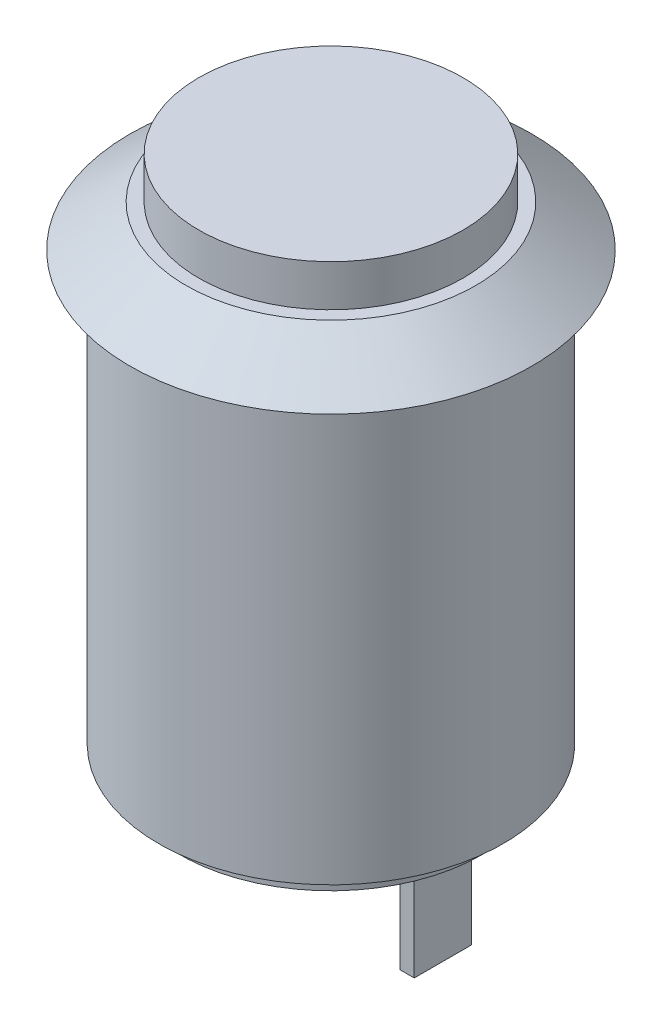
ISO-10303-21;
HEADER;
FILE_DESCRIPTION(('STEP AP214'),'2;1');
FILE_NAME('part.step','',(''),(''),'','','');
FILE_SCHEMA(('AUTOMOTIVE_DESIGN { 1 0 10303 214 1 1 1 1 }'));
ENDSEC;
DATA;
#1=APPLICATION_CONTEXT('core data for automotive mechanical design processes');
#2=APPLICATION_PROTOCOL_DEFINITION('international standard','automotive_design',2000,#1);
#3=PRODUCT_CONTEXT('',#1,'mechanical');
#4=PRODUCT('Part','Part','',(#3));
#5=PRODUCT_RELATED_PRODUCT_CATEGORY('part','',(#4));
#6=PRODUCT_DEFINITION_FORMATION('','',#4);
#7=PRODUCT_DEFINITION_CONTEXT('part definition',#1,'design');
#8=PRODUCT_DEFINITION('design','',#6,#7);
#9=PRODUCT_DEFINITION_SHAPE('','',#8);
#10=(LENGTH_UNIT() NAMED_UNIT(*) SI_UNIT(.MILLI.,.METRE.));
#11=(NAMED_UNIT(*) PLANE_ANGLE_UNIT() SI_UNIT($,.RADIAN.));
#12=(NAMED_UNIT(*) SI_UNIT($,.STERADIAN.) SOLID_ANGLE_UNIT());
#13=UNCERTAINTY_MEASURE_WITH_UNIT(LENGTH_MEASURE(1.E-05),#10,'distance_accuracy_value','');
#14=(GEOMETRIC_REPRESENTATION_CONTEXT(3) GLOBAL_UNCERTAINTY_ASSIGNED_CONTEXT((#13)) GLOBAL_UNIT_ASSIGNED_CONTEXT((#10,
#11,#12)) REPRESENTATION_CONTEXT('',''));
#15=CARTESIAN_POINT('',(0.,0.,0.));
#16=DIRECTION('',(0.,0.,1.));
#17=DIRECTION('',(1.,0.,0.));
#18=AXIS2_PLACEMENT_3D('',#15,#16,#17);
#19=CARTESIAN_POINT('',(0.,-15.6,0.));
#20=DIRECTION('',(0.,-1.,0.));
#21=DIRECTION('',(1.,0.,0.));
#22=AXIS2_PLACEMENT_3D('',#19,#20,#21);
#23=PLANE('',#22);
#24=CARTESIAN_POINT('',(0.,-15.6,0.));
#25=DIRECTION('',(0.,-1.,0.));
#26=DIRECTION('',(1.,0.,0.));
#27=AXIS2_PLACEMENT_3D('',#24,#25,#26);
#28=CIRCLE('',#27,5.26406953456615);
#29=CARTESIAN_POINT('',(5.26406953456615,-15.6,0.));
#30=VERTEX_POINT('',#29);
#31=EDGE_CURVE('E197',#30,#30,#28,.T.);
#32=ORIENTED_EDGE('',*,*,#31,.T.);
#33=EDGE_LOOP('',(#32));
#34=FACE_BOUND('',#33,.T.);
#35=DIRECTION('',(-1.,0.,0.));
#36=VECTOR('',#35,1.);
#37=CARTESIAN_POINT('',(-3.9,-15.6,1.));
#38=LINE('',#37,#36);
#39=CARTESIAN_POINT('',(-3.4,-15.6,1.));
#40=VERTEX_POINT('',#39);
#41=CARTESIAN_POINT('',(-3.9,-15.6,1.));
#42=VERTEX_POINT('',#41);
#43=EDGE_CURVE('E148',#40,#42,#38,.T.);
#44=ORIENTED_EDGE('',*,*,#43,.F.);
#45=DIRECTION('',(0.,0.,1.));
#46=VECTOR('',#45,1.);
#47=CARTESIAN_POINT('',(-3.4,-15.6,1.));
#48=LINE('',#47,#46);
#49=CARTESIAN_POINT('',(-3.4,-15.6,-1.));
#50=VERTEX_POINT('',#49);
#51=EDGE_CURVE('E143',#50,#40,#48,.T.);
#52=ORIENTED_EDGE('',*,*,#51,.F.);
#53=DIRECTION('',(1.,0.,0.));
#54=VECTOR('',#53,1.);
#55=CARTESIAN_POINT('',(-3.9,-15.6,-1.));
#56=LINE('',#55,#54);
#57=CARTESIAN_POINT('',(-3.9,-15.6,-1.));
#58=VERTEX_POINT('',#57);
#59=EDGE_CURVE('E168',#58,#50,#56,.T.);
#60=ORIENTED_EDGE('',*,*,#59,.F.);
#61=DIRECTION('',(0.,0.,-1.));
#62=VECTOR('',#61,1.);
#63=CARTESIAN_POINT('',(-3.9,-15.6,1.));
#64=LINE('',#63,#62);
#65=EDGE_CURVE('E180',#42,#58,#64,.T.);
#66=ORIENTED_EDGE('',*,*,#65,.F.);
#67=EDGE_LOOP('',(#44,#52,#60,#66));
#68=FACE_BOUND('',#67,.T.);
#69=DIRECTION('',(-1.,0.,0.));
#70=VECTOR('',#69,1.);
#71=CARTESIAN_POINT('',(3.4,-15.6,1.));
#72=LINE('',#71,#70);
#73=CARTESIAN_POINT('',(3.9,-15.6,1.));
#74=VERTEX_POINT('',#73);
#75=CARTESIAN_POINT('',(3.4,-15.6,1.));
#76=VERTEX_POINT('',#75);
#77=EDGE_CURVE('E141',#74,#76,#72,.T.);
#78=ORIENTED_EDGE('',*,*,#77,.F.);
#79=DIRECTION('',(0.,0.,1.));
#80=VECTOR('',#79,1.);
#81=CARTESIAN_POINT('',(3.9,-15.6,1.));
#82=LINE('',#81,#80);
#83=CARTESIAN_POINT('',(3.9,-15.6,-0.999999999999999));
#84=VERTEX_POINT('',#83);
#85=EDGE_CURVE('E135',#84,#74,#82,.T.);
#86=ORIENTED_EDGE('',*,*,#85,.F.);
#87=DIRECTION('',(1.,0.,0.));
#88=VECTOR('',#87,1.);
#89=CARTESIAN_POINT('',(3.4,-15.6,-0.999999999999999));
#90=LINE('',#89,#88);
#91=CARTESIAN_POINT('',(3.4,-15.6,-0.999999999999999));
#92=VERTEX_POINT('',#91);
#93=EDGE_CURVE('E119',#92,#84,#90,.T.);
#94=ORIENTED_EDGE('',*,*,#93,.F.);
#95=DIRECTION('',(0.,0.,-1.));
#96=VECTOR('',#95,1.);
#97=CARTESIAN_POINT('',(3.4,-15.6,1.));
#98=LINE('',#97,#96);
#99=EDGE_CURVE('E128',#76,#92,#98,.T.);
#100=ORIENTED_EDGE('',*,*,#99,.F.);
#101=EDGE_LOOP('',(#78,#86,#94,#100));
#102=FACE_BOUND('',#101,.T.);
#103=ADVANCED_FACE('F51',(#34,#68,#102),#23,.T.);
#104=CARTESIAN_POINT('',(0.,-14.9,0.));
#105=DIRECTION('',(0.,1.,0.));
#106=DIRECTION('',(-1.,0.,0.));
#107=AXIS2_PLACEMENT_3D('',#104,#105,#106);
#108=PLANE('',#107);
#109=CARTESIAN_POINT('',(0.,-14.9,0.));
#110=DIRECTION('',(0.,-1.,0.));
#111=DIRECTION('',(1.,0.,0.));
#112=AXIS2_PLACEMENT_3D('',#109,#110,#111);
#113=CIRCLE('',#112,5.26406953456615);
#114=CARTESIAN_POINT('',(5.26406953456615,-14.9,0.));
#115=VERTEX_POINT('',#114);
#116=EDGE_CURVE('E11',#115,#115,#113,.T.);
#117=ORIENTED_EDGE('',*,*,#116,.F.);
#118=EDGE_LOOP('',(#117));
#119=FACE_BOUND('',#118,.T.);
#120=CARTESIAN_POINT('',(0.,-14.9,0.));
#121=DIRECTION('',(0.,1.,0.));
#122=DIRECTION('',(-1.,0.,0.));
#123=AXIS2_PLACEMENT_3D('',#120,#121,#122);
#124=CIRCLE('',#123,6.);
#125=CARTESIAN_POINT('',(-6.,-14.9,0.));
#126=VERTEX_POINT('',#125);
#127=EDGE_CURVE('E55',#126,#126,#124,.T.);
#128=ORIENTED_EDGE('',*,*,#127,.F.);
#129=EDGE_LOOP('',(#128));
#130=FACE_BOUND('',#129,.T.);
#131=ADVANCED_FACE('F53',(#119,#130),#108,.F.);
#132=CARTESIAN_POINT('',(0.,2.9,0.));
#133=DIRECTION('',(0.,1.,0.));
#134=DIRECTION('',(-1.,0.,0.));
#135=AXIS2_PLACEMENT_3D('',#132,#133,#134);
#136=CYLINDRICAL_SURFACE('',#135,6.);
#137=CARTESIAN_POINT('',(0.,0.,0.));
#138=DIRECTION('',(0.,1.,0.));
#139=DIRECTION('',(-1.,0.,0.));
#140=AXIS2_PLACEMENT_3D('',#137,#138,#139);
#141=CIRCLE('',#140,6.);
#142=CARTESIAN_POINT('',(-6.,0.,0.));
#143=VERTEX_POINT('',#142);
#144=EDGE_CURVE('E216',#143,#143,#141,.T.);
#145=ORIENTED_EDGE('',*,*,#144,.F.);
#146=EDGE_LOOP('',(#145));
#147=FACE_BOUND('',#146,.T.);
#148=ORIENTED_EDGE('',*,*,#127,.T.);
#149=EDGE_LOOP('',(#148));
#150=FACE_BOUND('',#149,.T.);
#151=ADVANCED_FACE('F225',(#147,#150),#136,.T.);
#152=CARTESIAN_POINT('',(6.,0.,0.));
#153=DIRECTION('',(0.,1.,0.));
#154=DIRECTION('',(-1.,0.,0.));
#155=AXIS2_PLACEMENT_3D('',#152,#153,#154);
#156=PLANE('',#155);
#157=CARTESIAN_POINT('',(0.,0.,0.));
#158=DIRECTION('',(0.,1.,0.));
#159=DIRECTION('',(-1.,0.,0.));
#160=AXIS2_PLACEMENT_3D('',#157,#158,#159);
#161=CIRCLE('',#160,7.);
#162=CARTESIAN_POINT('',(-7.,0.,0.));
#163=VERTEX_POINT('',#162);
#164=EDGE_CURVE('E213',#163,#163,#161,.T.);
#165=ORIENTED_EDGE('',*,*,#164,.F.);
#166=EDGE_LOOP('',(#165));
#167=FACE_BOUND('',#166,.T.);
#168=ORIENTED_EDGE('',*,*,#144,.T.);
#169=EDGE_LOOP('',(#168));
#170=FACE_BOUND('',#169,.T.);
#171=ADVANCED_FACE('F234',(#167,#170),#156,.F.);
#172=CARTESIAN_POINT('',(0.,0.,0.));
#173=DIRECTION('',(0.,-1.,0.));
#174=DIRECTION('',(1.,0.,0.));
#175=AXIS2_PLACEMENT_3D('',#172,#173,#174);
#176=CONICAL_SURFACE('',#175,7.,0.933056955493122);
#177=CARTESIAN_POINT('',(0.,1.45,0.));
#178=DIRECTION('',(0.,1.,0.));
#179=DIRECTION('',(-1.,0.,0.));
#180=AXIS2_PLACEMENT_3D('',#177,#178,#179);
#181=CIRCLE('',#180,5.04327974389335);
#182=CARTESIAN_POINT('',(-5.04327974389335,1.45,0.));
#183=VERTEX_POINT('',#182);
#184=EDGE_CURVE('E209',#183,#183,#181,.T.);
#185=ORIENTED_EDGE('',*,*,#184,.F.);
#186=EDGE_LOOP('',(#185));
#187=FACE_BOUND('',#186,.T.);
#188=ORIENTED_EDGE('',*,*,#164,.T.);
#189=EDGE_LOOP('',(#188));
#190=FACE_BOUND('',#189,.T.);
#191=ADVANCED_FACE('F264',(#187,#190),#176,.T.);
#192=CARTESIAN_POINT('',(5.04327974389335,1.45,0.));
#193=DIRECTION('',(0.,-1.,0.));
#194=DIRECTION('',(1.,0.,0.));
#195=AXIS2_PLACEMENT_3D('',#192,#193,#194);
#196=PLANE('',#195);
#197=CARTESIAN_POINT('',(0.,1.45,0.));
#198=DIRECTION('',(0.,1.,0.));
#199=DIRECTION('',(-1.,0.,0.));
#200=AXIS2_PLACEMENT_3D('',#197,#198,#199);
#201=CIRCLE('',#200,4.6);
#202=CARTESIAN_POINT('',(-4.6,1.45,0.));
#203=VERTEX_POINT('',#202);
#204=EDGE_CURVE('E205',#203,#203,#201,.T.);
#205=ORIENTED_EDGE('',*,*,#204,.F.);
#206=EDGE_LOOP('',(#205));
#207=FACE_BOUND('',#206,.T.);
#208=ORIENTED_EDGE('',*,*,#184,.T.);
#209=EDGE_LOOP('',(#208));
#210=FACE_BOUND('',#209,.T.);
#211=ADVANCED_FACE('F260',(#207,#210),#196,.F.);
#212=CARTESIAN_POINT('',(0.,2.9,0.));
#213=DIRECTION('',(0.,1.,0.));
#214=DIRECTION('',(-1.,0.,0.));
#215=AXIS2_PLACEMENT_3D('',#212,#213,#214);
#216=CYLINDRICAL_SURFACE('',#215,4.6);
#217=CARTESIAN_POINT('',(0.,2.9,0.));
#218=DIRECTION('',(0.,1.,0.));
#219=DIRECTION('',(-1.,0.,0.));
#220=AXIS2_PLACEMENT_3D('',#217,#218,#219);
#221=CIRCLE('',#220,4.6);
#222=CARTESIAN_POINT('',(-4.6,2.9,0.));
#223=VERTEX_POINT('',#222);
#224=EDGE_CURVE('E200',#223,#223,#221,.T.);
#225=ORIENTED_EDGE('',*,*,#224,.F.);
#226=EDGE_LOOP('',(#225));
#227=FACE_BOUND('',#226,.T.);
#228=ORIENTED_EDGE('',*,*,#204,.T.);
#229=EDGE_LOOP('',(#228));
#230=FACE_BOUND('',#229,.T.);
#231=ADVANCED_FACE('F253',(#227,#230),#216,.T.);
#232=CARTESIAN_POINT('',(4.6,2.9,0.));
#233=DIRECTION('',(0.,-1.,0.));
#234=DIRECTION('',(1.,0.,0.));
#235=AXIS2_PLACEMENT_3D('',#232,#233,#234);
#236=PLANE('',#235);
#237=ORIENTED_EDGE('',*,*,#224,.T.);
#238=EDGE_LOOP('',(#237));
#239=FACE_BOUND('',#238,.T.);
#240=ADVANCED_FACE('F244',(#239),#236,.F.);
#241=CARTESIAN_POINT('',(0.,-15.6,0.));
#242=DIRECTION('',(0.,1.,0.));
#243=DIRECTION('',(-1.,0.,0.));
#244=AXIS2_PLACEMENT_3D('',#241,#242,#243);
#245=CYLINDRICAL_SURFACE('',#244,5.26406953456615);
#246=ORIENTED_EDGE('',*,*,#31,.F.);
#247=EDGE_LOOP('',(#246));
#248=FACE_BOUND('',#247,.T.);
#249=ORIENTED_EDGE('',*,*,#116,.T.);
#250=EDGE_LOOP('',(#249));
#251=FACE_BOUND('',#250,.T.);
#252=ADVANCED_FACE('F241',(#248,#251),#245,.T.);
#253=CARTESIAN_POINT('',(-3.4,-19.5,1.));
#254=DIRECTION('',(-1.,0.,0.));
#255=DIRECTION('',(0.,0.,1.));
#256=AXIS2_PLACEMENT_3D('',#253,#254,#255);
#257=PLANE('',#256);
#258=ORIENTED_EDGE('',*,*,#51,.T.);
#259=DIRECTION('',(0.,1.,0.));
#260=VECTOR('',#259,1.);
#261=CARTESIAN_POINT('',(-3.4,-19.5,1.));
#262=LINE('',#261,#260);
#263=CARTESIAN_POINT('',(-3.4,-19.5,1.));
#264=VERTEX_POINT('',#263);
#265=EDGE_CURVE('E194',#264,#40,#262,.T.);
#266=ORIENTED_EDGE('',*,*,#265,.F.);
#267=DIRECTION('',(0.,0.,1.));
#268=VECTOR('',#267,1.);
#269=CARTESIAN_POINT('',(-3.4,-19.5,1.));
#270=LINE('',#269,#268);
#271=CARTESIAN_POINT('',(-3.4,-19.5,-1.));
#272=VERTEX_POINT('',#271);
#273=EDGE_CURVE('E163',#272,#264,#270,.T.);
#274=ORIENTED_EDGE('',*,*,#273,.F.);
#275=DIRECTION('',(0.,1.,0.));
#276=VECTOR('',#275,1.);
#277=CARTESIAN_POINT('',(-3.4,-19.5,-1.));
#278=LINE('',#277,#276);
#279=EDGE_CURVE('E176',#272,#50,#278,.T.);
#280=ORIENTED_EDGE('',*,*,#279,.T.);
#281=EDGE_LOOP('',(#258,#266,#274,#280));
#282=FACE_BOUND('',#281,.T.);
#283=ADVANCED_FACE('F243',(#282),#257,.F.);
#284=CARTESIAN_POINT('',(-3.9,-19.5,1.));
#285=DIRECTION('',(0.,0.,-1.));
#286=DIRECTION('',(-1.,0.,0.));
#287=AXIS2_PLACEMENT_3D('',#284,#285,#286);
#288=PLANE('',#287);
#289=ORIENTED_EDGE('',*,*,#43,.T.);
#290=DIRECTION('',(0.,1.,0.));
#291=VECTOR('',#290,1.);
#292=CARTESIAN_POINT('',(-3.9,-19.5,1.));
#293=LINE('',#292,#291);
#294=CARTESIAN_POINT('',(-3.9,-19.5,1.));
#295=VERTEX_POINT('',#294);
#296=EDGE_CURVE('E190',#295,#42,#293,.T.);
#297=ORIENTED_EDGE('',*,*,#296,.F.);
#298=DIRECTION('',(-1.,0.,0.));
#299=VECTOR('',#298,1.);
#300=CARTESIAN_POINT('',(-3.9,-19.5,1.));
#301=LINE('',#300,#299);
#302=EDGE_CURVE('E167',#264,#295,#301,.T.);
#303=ORIENTED_EDGE('',*,*,#302,.F.);
#304=ORIENTED_EDGE('',*,*,#265,.T.);
#305=EDGE_LOOP('',(#289,#297,#303,#304));
#306=FACE_BOUND('',#305,.T.);
#307=ADVANCED_FACE('F250',(#306),#288,.F.);
#308=CARTESIAN_POINT('',(-3.9,-19.5,1.));
#309=DIRECTION('',(1.,0.,0.));
#310=DIRECTION('',(0.,0.,-1.));
#311=AXIS2_PLACEMENT_3D('',#308,#309,#310);
#312=PLANE('',#311);
#313=ORIENTED_EDGE('',*,*,#65,.T.);
#314=DIRECTION('',(0.,1.,0.));
#315=VECTOR('',#314,1.);
#316=CARTESIAN_POINT('',(-3.9,-19.5,-1.));
#317=LINE('',#316,#315);
#318=CARTESIAN_POINT('',(-3.9,-19.5,-1.));
#319=VERTEX_POINT('',#318);
#320=EDGE_CURVE('E76',#319,#58,#317,.T.);
#321=ORIENTED_EDGE('',*,*,#320,.F.);
#322=DIRECTION('',(0.,0.,-1.));
#323=VECTOR('',#322,1.);
#324=CARTESIAN_POINT('',(-3.9,-19.5,1.));
#325=LINE('',#324,#323);
#326=EDGE_CURVE('E171',#295,#319,#325,.T.);
#327=ORIENTED_EDGE('',*,*,#326,.F.);
#328=ORIENTED_EDGE('',*,*,#296,.T.);
#329=EDGE_LOOP('',(#313,#321,#327,#328));
#330=FACE_BOUND('',#329,.T.);
#331=ADVANCED_FACE('F331',(#330),#312,.F.);
#332=CARTESIAN_POINT('',(-3.9,-19.5,-1.));
#333=DIRECTION('',(0.,0.,1.));
#334=DIRECTION('',(1.,0.,0.));
#335=AXIS2_PLACEMENT_3D('',#332,#333,#334);
#336=PLANE('',#335);
#337=ORIENTED_EDGE('',*,*,#59,.T.);
#338=ORIENTED_EDGE('',*,*,#279,.F.);
#339=DIRECTION('',(1.,0.,0.));
#340=VECTOR('',#339,1.);
#341=CARTESIAN_POINT('',(-3.9,-19.5,-1.));
#342=LINE('',#341,#340);
#343=EDGE_CURVE('E174',#319,#272,#342,.T.);
#344=ORIENTED_EDGE('',*,*,#343,.F.);
#345=ORIENTED_EDGE('',*,*,#320,.T.);
#346=EDGE_LOOP('',(#337,#338,#344,#345));
#347=FACE_BOUND('',#346,.T.);
#348=ADVANCED_FACE('F343',(#347),#336,.F.);
#349=CARTESIAN_POINT('',(0.,-19.5,0.));
#350=DIRECTION('',(0.,-1.,0.));
#351=DIRECTION('',(0.,0.,-1.));
#352=AXIS2_PLACEMENT_3D('',#349,#350,#351);
#353=PLANE('',#352);
#354=ORIENTED_EDGE('',*,*,#273,.T.);
#355=ORIENTED_EDGE('',*,*,#302,.T.);
#356=ORIENTED_EDGE('',*,*,#326,.T.);
#357=ORIENTED_EDGE('',*,*,#343,.T.);
#358=EDGE_LOOP('',(#354,#355,#356,#357));
#359=FACE_BOUND('',#358,.T.);
#360=ADVANCED_FACE('F355',(#359),#353,.T.);
#361=CARTESIAN_POINT('',(3.9,-19.5,1.));
#362=DIRECTION('',(-1.,0.,0.));
#363=DIRECTION('',(0.,-1.,0.));
#364=AXIS2_PLACEMENT_3D('',#361,#362,#363);
#365=PLANE('',#364);
#366=ORIENTED_EDGE('',*,*,#85,.T.);
#367=DIRECTION('',(0.,1.,0.));
#368=VECTOR('',#367,1.);
#369=CARTESIAN_POINT('',(3.9,-19.5,1.));
#370=LINE('',#369,#368);
#371=CARTESIAN_POINT('',(3.9,-19.5,1.));
#372=VERTEX_POINT('',#371);
#373=EDGE_CURVE('E473',#372,#74,#370,.T.);
#374=ORIENTED_EDGE('',*,*,#373,.F.);
#375=DIRECTION('',(0.,0.,1.));
#376=VECTOR('',#375,1.);
#377=CARTESIAN_POINT('',(3.9,-19.5,1.));
#378=LINE('',#377,#376);
#379=CARTESIAN_POINT('',(3.9,-19.5,-0.999999999999999));
#380=VERTEX_POINT('',#379);
#381=EDGE_CURVE('E129',#380,#372,#378,.T.);
#382=ORIENTED_EDGE('',*,*,#381,.F.);
#383=DIRECTION('',(0.,1.,0.));
#384=VECTOR('',#383,1.);
#385=CARTESIAN_POINT('',(3.9,-19.5,-0.999999999999999));
#386=LINE('',#385,#384);
#387=EDGE_CURVE('E122',#380,#84,#386,.T.);
#388=ORIENTED_EDGE('',*,*,#387,.T.);
#389=EDGE_LOOP('',(#366,#374,#382,#388));
#390=FACE_BOUND('',#389,.T.);
#391=ADVANCED_FACE('F133',(#390),#365,.F.);
#392=CARTESIAN_POINT('',(3.4,-19.5,1.));
#393=DIRECTION('',(0.,0.,-1.));
#394=DIRECTION('',(-1.,0.,0.));
#395=AXIS2_PLACEMENT_3D('',#392,#393,#394);
#396=PLANE('',#395);
#397=ORIENTED_EDGE('',*,*,#77,.T.);
#398=DIRECTION('',(0.,1.,0.));
#399=VECTOR('',#398,1.);
#400=CARTESIAN_POINT('',(3.4,-19.5,1.));
#401=LINE('',#400,#399);
#402=CARTESIAN_POINT('',(3.4,-19.5,1.));
#403=VERTEX_POINT('',#402);
#404=EDGE_CURVE('E475',#403,#76,#401,.T.);
#405=ORIENTED_EDGE('',*,*,#404,.F.);
#406=DIRECTION('',(-1.,0.,0.));
#407=VECTOR('',#406,1.);
#408=CARTESIAN_POINT('',(3.4,-19.5,1.));
#409=LINE('',#408,#407);
#410=EDGE_CURVE('E158',#372,#403,#409,.T.);
#411=ORIENTED_EDGE('',*,*,#410,.F.);
#412=ORIENTED_EDGE('',*,*,#373,.T.);
#413=EDGE_LOOP('',(#397,#405,#411,#412));
#414=FACE_BOUND('',#413,.T.);
#415=ADVANCED_FACE('F377',(#414),#396,.F.);
#416=CARTESIAN_POINT('',(3.4,-19.5,1.));
#417=DIRECTION('',(1.,0.,0.));
#418=DIRECTION('',(0.,0.,-1.));
#419=AXIS2_PLACEMENT_3D('',#416,#417,#418);
#420=PLANE('',#419);
#421=ORIENTED_EDGE('',*,*,#99,.T.);
#422=DIRECTION('',(0.,1.,0.));
#423=VECTOR('',#422,1.);
#424=CARTESIAN_POINT('',(3.4,-19.5,-0.999999999999999));
#425=LINE('',#424,#423);
#426=CARTESIAN_POINT('',(3.4,-19.5,-0.999999999999999));
#427=VERTEX_POINT('',#426);
#428=EDGE_CURVE('E68',#427,#92,#425,.T.);
#429=ORIENTED_EDGE('',*,*,#428,.F.);
#430=DIRECTION('',(0.,0.,-1.));
#431=VECTOR('',#430,1.);
#432=CARTESIAN_POINT('',(3.4,-19.5,1.));
#433=LINE('',#432,#431);
#434=EDGE_CURVE('E155',#403,#427,#433,.T.);
#435=ORIENTED_EDGE('',*,*,#434,.F.);
#436=ORIENTED_EDGE('',*,*,#404,.T.);
#437=EDGE_LOOP('',(#421,#429,#435,#436));
#438=FACE_BOUND('',#437,.T.);
#439=ADVANCED_FACE('F388',(#438),#420,.F.);
#440=CARTESIAN_POINT('',(3.4,-19.5,-0.999999999999999));
#441=DIRECTION('',(0.,0.,1.));
#442=DIRECTION('',(1.,0.,0.));
#443=AXIS2_PLACEMENT_3D('',#440,#441,#442);
#444=PLANE('',#443);
#445=ORIENTED_EDGE('',*,*,#93,.T.);
#446=ORIENTED_EDGE('',*,*,#387,.F.);
#447=DIRECTION('',(1.,0.,0.));
#448=VECTOR('',#447,1.);
#449=CARTESIAN_POINT('',(3.4,-19.5,-0.999999999999999));
#450=LINE('',#449,#448);
#451=EDGE_CURVE('E139',#427,#380,#450,.T.);
#452=ORIENTED_EDGE('',*,*,#451,.F.);
#453=ORIENTED_EDGE('',*,*,#428,.T.);
#454=EDGE_LOOP('',(#445,#446,#452,#453));
#455=FACE_BOUND('',#454,.T.);
#456=ADVANCED_FACE('F121',(#455),#444,.F.);
#457=CARTESIAN_POINT('',(0.,-19.5,0.));
#458=DIRECTION('',(0.,-1.,0.));
#459=DIRECTION('',(0.,0.,-1.));
#460=AXIS2_PLACEMENT_3D('',#457,#458,#459);
#461=PLANE('',#460);
#462=ORIENTED_EDGE('',*,*,#381,.T.);
#463=ORIENTED_EDGE('',*,*,#410,.T.);
#464=ORIENTED_EDGE('',*,*,#434,.T.);
#465=ORIENTED_EDGE('',*,*,#451,.T.);
#466=EDGE_LOOP('',(#462,#463,#464,#465));
#467=FACE_BOUND('',#466,.T.);
#468=ADVANCED_FACE('F411',(#467),#461,.T.);
#469=CLOSED_SHELL('',(#103,#131,#151,#171,#191,#211,#231,#240,#252,#283,#307,#331,#348,#360,
#391,#415,#439,#456,#468));
#470=MANIFOLD_SOLID_BREP('B2',#469);
#471=ADVANCED_BREP_SHAPE_REPRESENTATION('',(#18,#470),#14);
#472=SHAPE_DEFINITION_REPRESENTATION(#9,#471);
ENDSEC;
END-ISO-10303-21;
